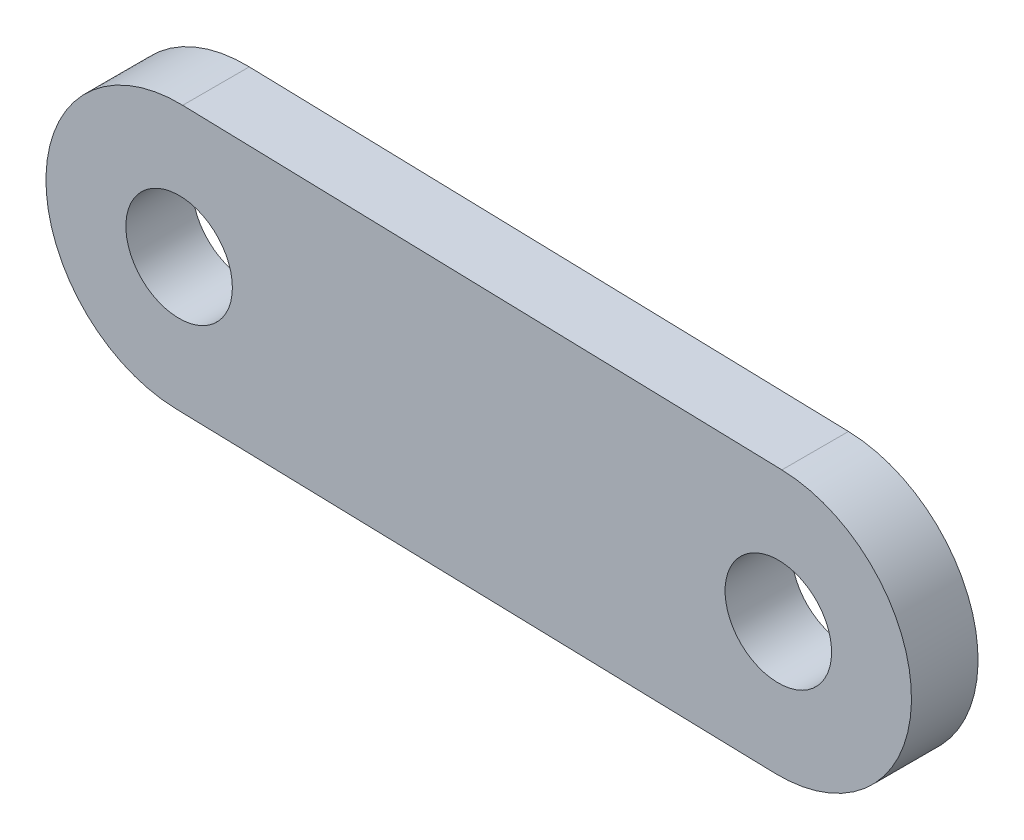
ISO-10303-21;
HEADER;
FILE_DESCRIPTION(('STEP AP214'),'2;1');
FILE_NAME('part.step','',(''),(''),'','','');
FILE_SCHEMA(('AUTOMOTIVE_DESIGN { 1 0 10303 214 1 1 1 1 }'));
ENDSEC;
DATA;
#1=APPLICATION_CONTEXT('core data for automotive mechanical design processes');
#2=APPLICATION_PROTOCOL_DEFINITION('international standard','automotive_design',2000,#1);
#3=PRODUCT_CONTEXT('',#1,'mechanical');
#4=PRODUCT('Part','Part','',(#3));
#5=PRODUCT_RELATED_PRODUCT_CATEGORY('part','',(#4));
#6=PRODUCT_DEFINITION_FORMATION('','',#4);
#7=PRODUCT_DEFINITION_CONTEXT('part definition',#1,'design');
#8=PRODUCT_DEFINITION('design','',#6,#7);
#9=PRODUCT_DEFINITION_SHAPE('','',#8);
#10=(LENGTH_UNIT() NAMED_UNIT(*) SI_UNIT(.MILLI.,.METRE.));
#11=(NAMED_UNIT(*) PLANE_ANGLE_UNIT() SI_UNIT($,.RADIAN.));
#12=(NAMED_UNIT(*) SI_UNIT($,.STERADIAN.) SOLID_ANGLE_UNIT());
#13=UNCERTAINTY_MEASURE_WITH_UNIT(LENGTH_MEASURE(1.E-05),#10,'distance_accuracy_value','');
#14=(GEOMETRIC_REPRESENTATION_CONTEXT(3) GLOBAL_UNCERTAINTY_ASSIGNED_CONTEXT((#13)) GLOBAL_UNIT_ASSIGNED_CONTEXT((#10,
#11,#12)) REPRESENTATION_CONTEXT('',''));
#15=CARTESIAN_POINT('',(0.,0.,0.));
#16=DIRECTION('',(0.,0.,1.));
#17=DIRECTION('',(1.,0.,0.));
#18=AXIS2_PLACEMENT_3D('',#15,#16,#17);
#19=CARTESIAN_POINT('',(-22.5,0.606100620625907,5.));
#20=DIRECTION('',(0.,0.,1.));
#21=DIRECTION('',(1.,0.,0.));
#22=AXIS2_PLACEMENT_3D('',#19,#20,#21);
#23=PLANE('',#22);
#24=CARTESIAN_POINT('',(22.5,-0.606100620625907,5.));
#25=DIRECTION('',(0.,0.,1.));
#26=DIRECTION('',(1.,0.,0.));
#27=AXIS2_PLACEMENT_3D('',#24,#25,#26);
#28=CIRCLE('',#27,4.);
#29=CARTESIAN_POINT('',(26.5,-0.606100620625907,5.));
#30=VERTEX_POINT('',#29);
#31=EDGE_CURVE('E100',#30,#30,#28,.T.);
#32=ORIENTED_EDGE('',*,*,#31,.F.);
#33=EDGE_LOOP('',(#32));
#34=FACE_BOUND('',#33,.T.);
#35=CARTESIAN_POINT('',(-22.5,0.606100620625907,5.));
#36=DIRECTION('',(0.,0.,1.));
#37=DIRECTION('',(1.,0.,0.));
#38=AXIS2_PLACEMENT_3D('',#35,#36,#37);
#39=CIRCLE('',#38,10.);
#40=CARTESIAN_POINT('',(-22.2307196296962,10.6024743672487,5.));
#41=VERTEX_POINT('',#40);
#42=CARTESIAN_POINT('',(-22.7692803703038,-9.39027312599687,5.));
#43=VERTEX_POINT('',#42);
#44=EDGE_CURVE('E85',#41,#43,#39,.T.);
#45=ORIENTED_EDGE('',*,*,#44,.T.);
#46=DIRECTION('',(0.999637374662277,-0.0269280370303846,0.));
#47=VECTOR('',#46,1.);
#48=CARTESIAN_POINT('',(-22.7692803703038,-9.39027312599687,5.));
#49=LINE('',#48,#47);
#50=CARTESIAN_POINT('',(22.2307196296962,-10.6024743672487,5.));
#51=VERTEX_POINT('',#50);
#52=EDGE_CURVE('E80',#43,#51,#49,.T.);
#53=ORIENTED_EDGE('',*,*,#52,.T.);
#54=CARTESIAN_POINT('',(22.5,-0.606100620625907,5.));
#55=DIRECTION('',(0.,0.,1.));
#56=DIRECTION('',(1.,0.,0.));
#57=AXIS2_PLACEMENT_3D('',#54,#55,#56);
#58=CIRCLE('',#57,10.);
#59=CARTESIAN_POINT('',(22.7692803703038,9.39027312599687,5.));
#60=VERTEX_POINT('',#59);
#61=EDGE_CURVE('E83',#51,#60,#58,.T.);
#62=ORIENTED_EDGE('',*,*,#61,.T.);
#63=DIRECTION('',(-0.999637374662277,0.0269280370303847,0.));
#64=VECTOR('',#63,1.);
#65=CARTESIAN_POINT('',(-22.2307196296962,10.6024743672487,5.));
#66=LINE('',#65,#64);
#67=EDGE_CURVE('E50',#60,#41,#66,.T.);
#68=ORIENTED_EDGE('',*,*,#67,.T.);
#69=EDGE_LOOP('',(#45,#53,#62,#68));
#70=FACE_BOUND('',#69,.T.);
#71=CARTESIAN_POINT('',(-22.5,0.606100620625907,5.));
#72=DIRECTION('',(0.,0.,1.));
#73=DIRECTION('',(1.,0.,0.));
#74=AXIS2_PLACEMENT_3D('',#71,#72,#73);
#75=CIRCLE('',#74,4.);
#76=CARTESIAN_POINT('',(-18.5,0.606100620625907,5.));
#77=VERTEX_POINT('',#76);
#78=EDGE_CURVE('E115',#77,#77,#75,.T.);
#79=ORIENTED_EDGE('',*,*,#78,.F.);
#80=EDGE_LOOP('',(#79));
#81=FACE_BOUND('',#80,.T.);
#82=ADVANCED_FACE('F33',(#34,#70,#81),#23,.T.);
#83=CARTESIAN_POINT('',(-22.5,0.606100620625907,0.));
#84=DIRECTION('',(0.,0.,1.));
#85=DIRECTION('',(1.,0.,0.));
#86=AXIS2_PLACEMENT_3D('',#83,#84,#85);
#87=PLANE('',#86);
#88=CARTESIAN_POINT('',(-22.5,0.606100620625907,0.));
#89=DIRECTION('',(0.,0.,1.));
#90=DIRECTION('',(1.,0.,0.));
#91=AXIS2_PLACEMENT_3D('',#88,#89,#90);
#92=CIRCLE('',#91,10.);
#93=CARTESIAN_POINT('',(-22.2307196296962,10.6024743672487,0.));
#94=VERTEX_POINT('',#93);
#95=CARTESIAN_POINT('',(-22.7692803703038,-9.39027312599687,0.));
#96=VERTEX_POINT('',#95);
#97=EDGE_CURVE('E97',#94,#96,#92,.T.);
#98=ORIENTED_EDGE('',*,*,#97,.F.);
#99=DIRECTION('',(-0.999637374662277,0.0269280370303847,0.));
#100=VECTOR('',#99,1.);
#101=CARTESIAN_POINT('',(-22.2307196296962,10.6024743672487,0.));
#102=LINE('',#101,#100);
#103=CARTESIAN_POINT('',(22.7692803703038,9.39027312599687,0.));
#104=VERTEX_POINT('',#103);
#105=EDGE_CURVE('E73',#104,#94,#102,.T.);
#106=ORIENTED_EDGE('',*,*,#105,.F.);
#107=CARTESIAN_POINT('',(22.5,-0.606100620625907,0.));
#108=DIRECTION('',(0.,0.,1.));
#109=DIRECTION('',(1.,0.,0.));
#110=AXIS2_PLACEMENT_3D('',#107,#108,#109);
#111=CIRCLE('',#110,10.);
#112=CARTESIAN_POINT('',(22.2307196296962,-10.6024743672487,0.));
#113=VERTEX_POINT('',#112);
#114=EDGE_CURVE('E67',#113,#104,#111,.T.);
#115=ORIENTED_EDGE('',*,*,#114,.F.);
#116=DIRECTION('',(0.999637374662277,-0.0269280370303846,0.));
#117=VECTOR('',#116,1.);
#118=CARTESIAN_POINT('',(-22.7692803703038,-9.39027312599687,0.));
#119=LINE('',#118,#117);
#120=EDGE_CURVE('E89',#96,#113,#119,.T.);
#121=ORIENTED_EDGE('',*,*,#120,.F.);
#122=EDGE_LOOP('',(#98,#106,#115,#121));
#123=FACE_BOUND('',#122,.T.);
#124=CARTESIAN_POINT('',(22.5,-0.606100620625907,0.));
#125=DIRECTION('',(0.,0.,1.));
#126=DIRECTION('',(1.,0.,0.));
#127=AXIS2_PLACEMENT_3D('',#124,#125,#126);
#128=CIRCLE('',#127,4.);
#129=CARTESIAN_POINT('',(26.5,-0.606100620625907,0.));
#130=VERTEX_POINT('',#129);
#131=EDGE_CURVE('E112',#130,#130,#128,.T.);
#132=ORIENTED_EDGE('',*,*,#131,.T.);
#133=EDGE_LOOP('',(#132));
#134=FACE_BOUND('',#133,.T.);
#135=CARTESIAN_POINT('',(-22.5,0.606100620625907,0.));
#136=DIRECTION('',(0.,0.,1.));
#137=DIRECTION('',(1.,0.,0.));
#138=AXIS2_PLACEMENT_3D('',#135,#136,#137);
#139=CIRCLE('',#138,4.);
#140=CARTESIAN_POINT('',(-18.5,0.606100620625907,0.));
#141=VERTEX_POINT('',#140);
#142=EDGE_CURVE('E118',#141,#141,#139,.T.);
#143=ORIENTED_EDGE('',*,*,#142,.T.);
#144=EDGE_LOOP('',(#143));
#145=FACE_BOUND('',#144,.T.);
#146=ADVANCED_FACE('F108',(#123,#134,#145),#87,.F.);
#147=CARTESIAN_POINT('',(-22.5,0.606100620625907,5.));
#148=DIRECTION('',(0.,0.,-1.));
#149=DIRECTION('',(-1.,0.,0.));
#150=AXIS2_PLACEMENT_3D('',#147,#148,#149);
#151=CYLINDRICAL_SURFACE('',#150,10.);
#152=ORIENTED_EDGE('',*,*,#97,.T.);
#153=DIRECTION('',(0.,0.,-1.));
#154=VECTOR('',#153,1.);
#155=CARTESIAN_POINT('',(-22.7692803703038,-9.39027312599687,5.));
#156=LINE('',#155,#154);
#157=EDGE_CURVE('E11',#43,#96,#156,.T.);
#158=ORIENTED_EDGE('',*,*,#157,.F.);
#159=ORIENTED_EDGE('',*,*,#44,.F.);
#160=DIRECTION('',(0.,0.,-1.));
#161=VECTOR('',#160,1.);
#162=CARTESIAN_POINT('',(-22.2307196296962,10.6024743672487,5.));
#163=LINE('',#162,#161);
#164=EDGE_CURVE('E93',#41,#94,#163,.T.);
#165=ORIENTED_EDGE('',*,*,#164,.T.);
#166=EDGE_LOOP('',(#152,#158,#159,#165));
#167=FACE_BOUND('',#166,.T.);
#168=ADVANCED_FACE('F35',(#167),#151,.T.);
#169=CARTESIAN_POINT('',(-22.7692803703038,-9.39027312599687,5.));
#170=DIRECTION('',(0.0269280370303847,0.999637374662277,0.));
#171=DIRECTION('',(-0.999637374662278,0.0269280370303847,0.));
#172=AXIS2_PLACEMENT_3D('',#169,#170,#171);
#173=PLANE('',#172);
#174=ORIENTED_EDGE('',*,*,#120,.T.);
#175=DIRECTION('',(0.,0.,-1.));
#176=VECTOR('',#175,1.);
#177=CARTESIAN_POINT('',(22.2307196296962,-10.6024743672487,5.));
#178=LINE('',#177,#176);
#179=EDGE_CURVE('E42',#51,#113,#178,.T.);
#180=ORIENTED_EDGE('',*,*,#179,.F.);
#181=ORIENTED_EDGE('',*,*,#52,.F.);
#182=ORIENTED_EDGE('',*,*,#157,.T.);
#183=EDGE_LOOP('',(#174,#180,#181,#182));
#184=FACE_BOUND('',#183,.T.);
#185=ADVANCED_FACE('F88',(#184),#173,.F.);
#186=CARTESIAN_POINT('',(22.5,-0.606100620625907,5.));
#187=DIRECTION('',(0.,0.,-1.));
#188=DIRECTION('',(-1.,0.,0.));
#189=AXIS2_PLACEMENT_3D('',#186,#187,#188);
#190=CYLINDRICAL_SURFACE('',#189,10.);
#191=ORIENTED_EDGE('',*,*,#114,.T.);
#192=DIRECTION('',(0.,0.,-1.));
#193=VECTOR('',#192,1.);
#194=CARTESIAN_POINT('',(22.7692803703038,9.39027312599687,5.));
#195=LINE('',#194,#193);
#196=EDGE_CURVE('E90',#60,#104,#195,.T.);
#197=ORIENTED_EDGE('',*,*,#196,.F.);
#198=ORIENTED_EDGE('',*,*,#61,.F.);
#199=ORIENTED_EDGE('',*,*,#179,.T.);
#200=EDGE_LOOP('',(#191,#197,#198,#199));
#201=FACE_BOUND('',#200,.T.);
#202=ADVANCED_FACE('F91',(#201),#190,.T.);
#203=CARTESIAN_POINT('',(-22.2307196296962,10.6024743672487,5.));
#204=DIRECTION('',(-0.0269280370303847,-0.999637374662277,0.));
#205=DIRECTION('',(0.999637374662277,-0.0269280370303847,0.));
#206=AXIS2_PLACEMENT_3D('',#203,#204,#205);
#207=PLANE('',#206);
#208=ORIENTED_EDGE('',*,*,#105,.T.);
#209=ORIENTED_EDGE('',*,*,#164,.F.);
#210=ORIENTED_EDGE('',*,*,#67,.F.);
#211=ORIENTED_EDGE('',*,*,#196,.T.);
#212=EDGE_LOOP('',(#208,#209,#210,#211));
#213=FACE_BOUND('',#212,.T.);
#214=ADVANCED_FACE('F105',(#213),#207,.F.);
#215=CARTESIAN_POINT('',(22.5,-0.606100620625907,5.));
#216=DIRECTION('',(0.,0.,-1.));
#217=DIRECTION('',(-1.,0.,0.));
#218=AXIS2_PLACEMENT_3D('',#215,#216,#217);
#219=CYLINDRICAL_SURFACE('',#218,4.);
#220=ORIENTED_EDGE('',*,*,#31,.T.);
#221=EDGE_LOOP('',(#220));
#222=FACE_BOUND('',#221,.T.);
#223=ORIENTED_EDGE('',*,*,#131,.F.);
#224=EDGE_LOOP('',(#223));
#225=FACE_BOUND('',#224,.T.);
#226=ADVANCED_FACE('F135',(#222,#225),#219,.F.);
#227=CARTESIAN_POINT('',(-22.5,0.606100620625907,5.));
#228=DIRECTION('',(0.,0.,-1.));
#229=DIRECTION('',(-1.,0.,0.));
#230=AXIS2_PLACEMENT_3D('',#227,#228,#229);
#231=CYLINDRICAL_SURFACE('',#230,4.);
#232=ORIENTED_EDGE('',*,*,#78,.T.);
#233=EDGE_LOOP('',(#232));
#234=FACE_BOUND('',#233,.T.);
#235=ORIENTED_EDGE('',*,*,#142,.F.);
#236=EDGE_LOOP('',(#235));
#237=FACE_BOUND('',#236,.T.);
#238=ADVANCED_FACE('F124',(#234,#237),#231,.F.);
#239=CLOSED_SHELL('',(#82,#146,#168,#185,#202,#214,#226,#238));
#240=MANIFOLD_SOLID_BREP('B2',#239);
#241=ADVANCED_BREP_SHAPE_REPRESENTATION('',(#18,#240),#14);
#242=SHAPE_DEFINITION_REPRESENTATION(#9,#241);
ENDSEC;
END-ISO-10303-21;
